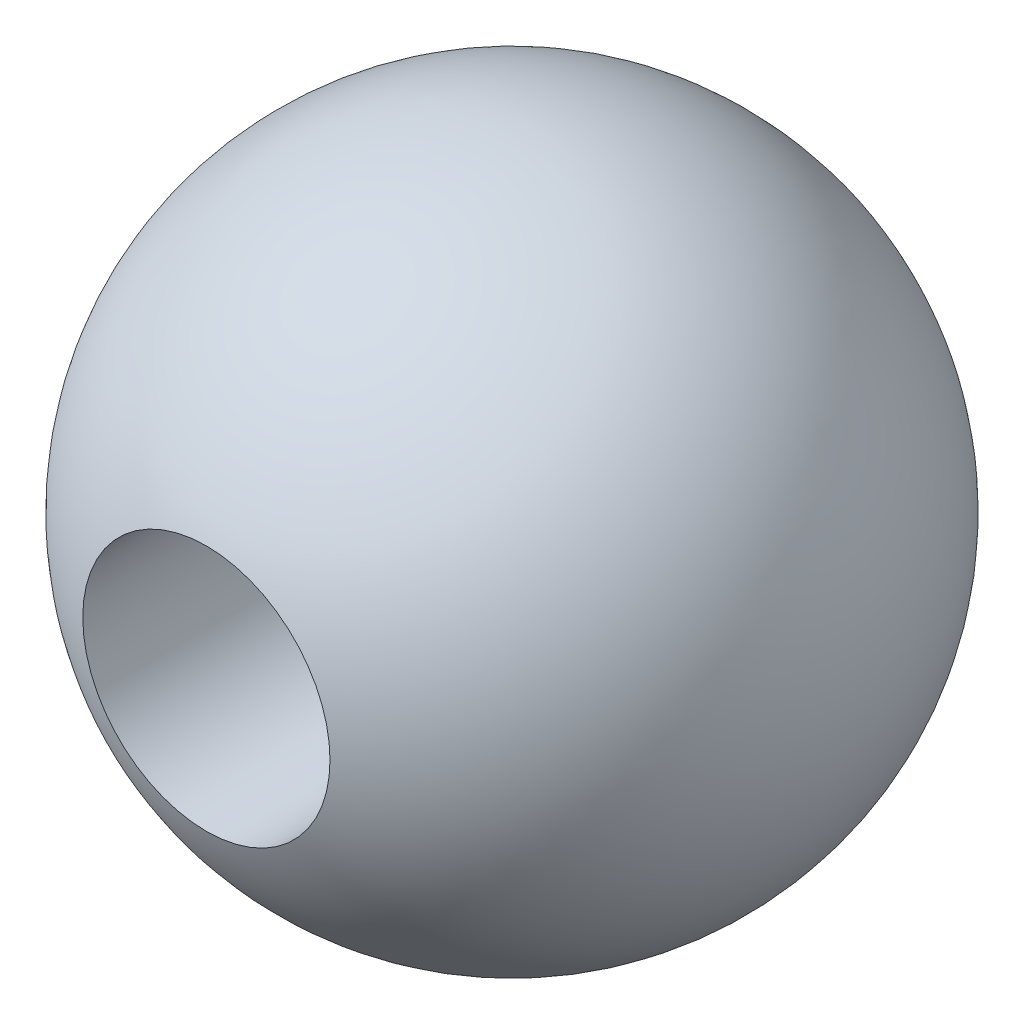
ISO-10303-21;
HEADER;
FILE_DESCRIPTION(('STEP AP214'),'2;1');
FILE_NAME('part.step','',(''),(''),'','','');
FILE_SCHEMA(('AUTOMOTIVE_DESIGN { 1 0 10303 214 1 1 1 1 }'));
ENDSEC;
DATA;
#1=APPLICATION_CONTEXT('core data for automotive mechanical design processes');
#2=APPLICATION_PROTOCOL_DEFINITION('international standard','automotive_design',2000,#1);
#3=PRODUCT_CONTEXT('',#1,'mechanical');
#4=PRODUCT('Part','Part','',(#3));
#5=PRODUCT_RELATED_PRODUCT_CATEGORY('part','',(#4));
#6=PRODUCT_DEFINITION_FORMATION('','',#4);
#7=PRODUCT_DEFINITION_CONTEXT('part definition',#1,'design');
#8=PRODUCT_DEFINITION('design','',#6,#7);
#9=PRODUCT_DEFINITION_SHAPE('','',#8);
#10=(LENGTH_UNIT() NAMED_UNIT(*) SI_UNIT(.MILLI.,.METRE.));
#11=(NAMED_UNIT(*) PLANE_ANGLE_UNIT() SI_UNIT($,.RADIAN.));
#12=(NAMED_UNIT(*) SI_UNIT($,.STERADIAN.) SOLID_ANGLE_UNIT());
#13=UNCERTAINTY_MEASURE_WITH_UNIT(LENGTH_MEASURE(1.E-05),#10,'distance_accuracy_value','');
#14=(GEOMETRIC_REPRESENTATION_CONTEXT(3) GLOBAL_UNCERTAINTY_ASSIGNED_CONTEXT((#13)) GLOBAL_UNIT_ASSIGNED_CONTEXT((#10,
#11,#12)) REPRESENTATION_CONTEXT('',''));
#15=CARTESIAN_POINT('',(0.,0.,0.));
#16=DIRECTION('',(0.,0.,1.));
#17=DIRECTION('',(1.,0.,0.));
#18=AXIS2_PLACEMENT_3D('',#15,#16,#17);
#19=CARTESIAN_POINT('',(0.,0.,0.));
#20=DIRECTION('',(0.,1.,0.));
#21=DIRECTION('',(1.,0.,0.));
#22=AXIS2_PLACEMENT_3D('',#19,#20,#21);
#23=SPHERICAL_SURFACE('',#22,1.);
#24=CARTESIAN_POINT('',(0.,0.,0.));
#25=DIRECTION('',(0.,0.,-1.));
#26=DIRECTION('',(-1.,0.,0.));
#27=AXIS2_PLACEMENT_3D('',#24,#25,#26);
#28=SPHERICAL_SURFACE('',#27,1.);
#29=CARTESIAN_POINT('',(0.,0.,0.927024810886959));
#30=DIRECTION('',(0.,0.,-1.));
#31=DIRECTION('',(-1.,0.,0.));
#32=AXIS2_PLACEMENT_3D('',#29,#30,#31);
#33=CIRCLE('',#32,0.375);
#34=CARTESIAN_POINT('',(-0.375,0.,0.927024810886959));
#35=VERTEX_POINT('',#34);
#36=EDGE_CURVE('E10',#35,#35,#33,.F.);
#37=ORIENTED_EDGE('',*,*,#36,.F.);
#38=EDGE_LOOP('',(#37));
#39=FACE_BOUND('',#38,.T.);
#40=ADVANCED_FACE('F39',(#39),#28,.T.);
#41=CARTESIAN_POINT('',(0.,0.,0.320000000000001));
#42=DIRECTION('',(0.,0.,1.));
#43=DIRECTION('',(1.,0.,0.));
#44=AXIS2_PLACEMENT_3D('',#41,#42,#43);
#45=CYLINDRICAL_SURFACE('',#44,0.375);
#46=ORIENTED_EDGE('',*,*,#36,.T.);
#47=EDGE_LOOP('',(#46));
#48=FACE_BOUND('',#47,.T.);
#49=CARTESIAN_POINT('',(0.,0.,0.320000000000001));
#50=DIRECTION('',(0.,0.,1.));
#51=DIRECTION('',(1.,0.,0.));
#52=AXIS2_PLACEMENT_3D('',#49,#50,#51);
#53=CIRCLE('',#52,0.375);
#54=CARTESIAN_POINT('',(0.375,0.,0.320000000000001));
#55=VERTEX_POINT('',#54);
#56=EDGE_CURVE('E45',#55,#55,#53,.T.);
#57=ORIENTED_EDGE('',*,*,#56,.F.);
#58=EDGE_LOOP('',(#57));
#59=FACE_BOUND('',#58,.T.);
#60=ADVANCED_FACE('F53',(#48,#59),#45,.F.);
#61=CARTESIAN_POINT('',(0.,0.,0.320000000000001));
#62=DIRECTION('',(0.,0.,1.));
#63=DIRECTION('',(1.,0.,0.));
#64=AXIS2_PLACEMENT_3D('',#61,#62,#63);
#65=PLANE('',#64);
#66=ORIENTED_EDGE('',*,*,#56,.T.);
#67=EDGE_LOOP('',(#66));
#68=FACE_BOUND('',#67,.T.);
#69=ADVANCED_FACE('F51',(#68),#65,.T.);
#70=CLOSED_SHELL('',(#40,#60,#69));
#71=MANIFOLD_SOLID_BREP('B2',#70);
#72=ADVANCED_BREP_SHAPE_REPRESENTATION('',(#18,#71),#14);
#73=SHAPE_DEFINITION_REPRESENTATION(#9,#72);
ENDSEC;
END-ISO-10303-21;
